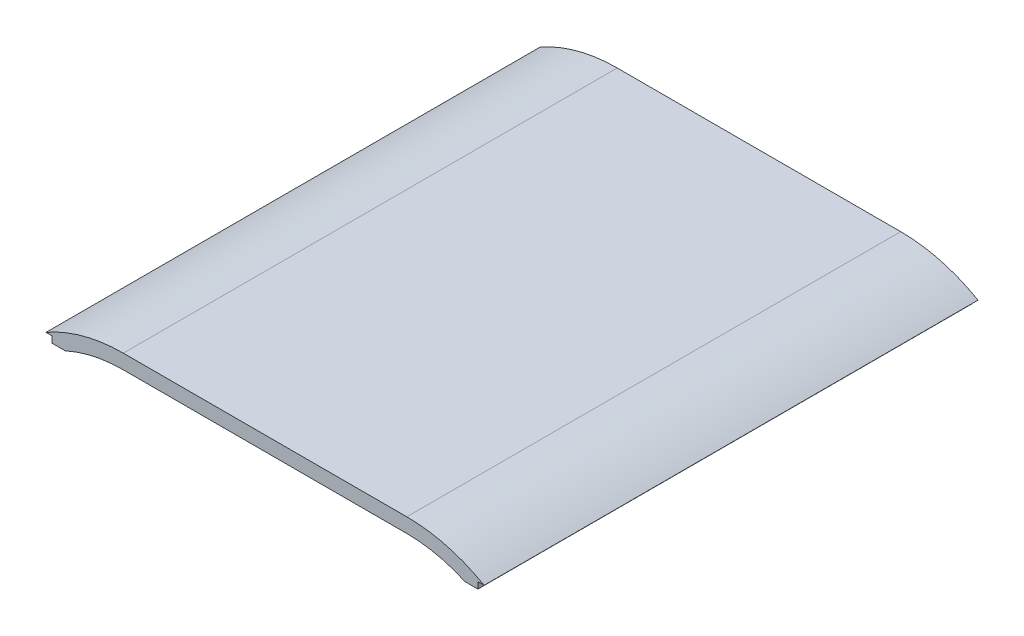
ISO-10303-21;
HEADER;
FILE_DESCRIPTION(('STEP AP214'),'2;1');
FILE_NAME('part.step','',(''),(''),'','','');
FILE_SCHEMA(('AUTOMOTIVE_DESIGN { 1 0 10303 214 1 1 1 1 }'));
ENDSEC;
DATA;
#1=APPLICATION_CONTEXT('core data for automotive mechanical design processes');
#2=APPLICATION_PROTOCOL_DEFINITION('international standard','automotive_design',2000,#1);
#3=PRODUCT_CONTEXT('',#1,'mechanical');
#4=PRODUCT('Part','Part','',(#3));
#5=PRODUCT_RELATED_PRODUCT_CATEGORY('part','',(#4));
#6=PRODUCT_DEFINITION_FORMATION('','',#4);
#7=PRODUCT_DEFINITION_CONTEXT('part definition',#1,'design');
#8=PRODUCT_DEFINITION('design','',#6,#7);
#9=PRODUCT_DEFINITION_SHAPE('','',#8);
#10=(LENGTH_UNIT() NAMED_UNIT(*) SI_UNIT(.MILLI.,.METRE.));
#11=(NAMED_UNIT(*) PLANE_ANGLE_UNIT() SI_UNIT($,.RADIAN.));
#12=(NAMED_UNIT(*) SI_UNIT($,.STERADIAN.) SOLID_ANGLE_UNIT());
#13=UNCERTAINTY_MEASURE_WITH_UNIT(LENGTH_MEASURE(1.E-05),#10,'distance_accuracy_value','');
#14=(GEOMETRIC_REPRESENTATION_CONTEXT(3) GLOBAL_UNCERTAINTY_ASSIGNED_CONTEXT((#13)) GLOBAL_UNIT_ASSIGNED_CONTEXT((#10,
#11,#12)) REPRESENTATION_CONTEXT('',''));
#15=CARTESIAN_POINT('',(0.,0.,0.));
#16=DIRECTION('',(0.,0.,1.));
#17=DIRECTION('',(1.,0.,0.));
#18=AXIS2_PLACEMENT_3D('',#15,#16,#17);
#19=CARTESIAN_POINT('',(-4.04219721862561E-10,-3.77974561371897E-12,238.999999999999));
#20=DIRECTION('',(0.,0.,1.));
#21=DIRECTION('',(1.,0.,0.));
#22=AXIS2_PLACEMENT_3D('',#19,#20,#21);
#23=PLANE('',#22);
#24=CARTESIAN_POINT('',(-68.5834261326637,87.2134363822639,238.999999999999));
#25=DIRECTION('',(0.,0.,1.));
#26=DIRECTION('',(1.,0.,0.));
#27=AXIS2_PLACEMENT_3D('',#24,#25,#26);
#28=CIRCLE('',#27,68.0000000000007);
#29=CARTESIAN_POINT('',(-68.5834261326637,155.213436382265,238.999999999999));
#30=VERTEX_POINT('',#29);
#31=CARTESIAN_POINT('',(-96.7212535541301,149.118708112545,238.999999999999));
#32=VERTEX_POINT('',#31);
#33=EDGE_CURVE('E129',#30,#32,#28,.T.);
#34=ORIENTED_EDGE('',*,*,#33,.F.);
#35=DIRECTION('',(1.,0.,0.));
#36=VECTOR('',#35,1.);
#37=CARTESIAN_POINT('',(0.,155.213436382264,238.999999999999));
#38=LINE('',#37,#36);
#39=CARTESIAN_POINT('',(68.5834261318553,155.213436382265,238.999999999999));
#40=VERTEX_POINT('',#39);
#41=EDGE_CURVE('E149',#30,#40,#38,.T.);
#42=ORIENTED_EDGE('',*,*,#41,.T.);
#43=CARTESIAN_POINT('',(68.5834261326637,87.2134363822639,238.999999999999));
#44=DIRECTION('',(0.,0.,1.));
#45=DIRECTION('',(1.,0.,0.));
#46=AXIS2_PLACEMENT_3D('',#43,#44,#45);
#47=CIRCLE('',#46,68.0000000000007);
#48=CARTESIAN_POINT('',(96.7212535541302,149.118708112545,238.999999999999));
#49=VERTEX_POINT('',#48);
#50=EDGE_CURVE('E151',#40,#49,#47,.F.);
#51=ORIENTED_EDGE('',*,*,#50,.T.);
#52=DIRECTION('',(1.,0.,0.));
#53=VECTOR('',#52,1.);
#54=CARTESIAN_POINT('',(0.,149.118708112545,238.999999999999));
#55=LINE('',#54,#53);
#56=CARTESIAN_POINT('',(103.000000000403,149.118708112545,238.999999999999));
#57=VERTEX_POINT('',#56);
#58=EDGE_CURVE('E153',#49,#57,#55,.T.);
#59=ORIENTED_EDGE('',*,*,#58,.T.);
#60=DIRECTION('',(0.,1.,0.));
#61=VECTOR('',#60,1.);
#62=CARTESIAN_POINT('',(103.000000000403,0.,238.999999999999));
#63=LINE('',#62,#61);
#64=CARTESIAN_POINT('',(103.000000000403,152.213436382267,238.999999999999));
#65=VERTEX_POINT('',#64);
#66=EDGE_CURVE('E155',#57,#65,#63,.T.);
#67=ORIENTED_EDGE('',*,*,#66,.T.);
#68=DIRECTION('',(1.,-1.13797860054735E-12,0.));
#69=VECTOR('',#68,1.);
#70=CARTESIAN_POINT('',(1.73215633318929E-10,152.213436382384,238.999999999999));
#71=LINE('',#70,#69);
#72=CARTESIAN_POINT('',(105.999999999595,152.213436382264,238.999999999999));
#73=VERTEX_POINT('',#72);
#74=EDGE_CURVE('E157',#65,#73,#71,.T.);
#75=ORIENTED_EDGE('',*,*,#74,.T.);
#76=CARTESIAN_POINT('',(68.5834261318553,87.2134363822639,238.999999999999));
#77=DIRECTION('',(0.,0.,1.));
#78=DIRECTION('',(1.,0.,0.));
#79=AXIS2_PLACEMENT_3D('',#76,#77,#78);
#80=CIRCLE('',#79,75.);
#81=CARTESIAN_POINT('',(68.5834261318553,162.213436382264,238.999999999999));
#82=VERTEX_POINT('',#81);
#83=EDGE_CURVE('E159',#73,#82,#80,.T.);
#84=ORIENTED_EDGE('',*,*,#83,.T.);
#85=DIRECTION('',(1.,0.,0.));
#86=VECTOR('',#85,1.);
#87=CARTESIAN_POINT('',(0.,162.213436382264,238.999999999999));
#88=LINE('',#87,#86);
#89=CARTESIAN_POINT('',(-68.5834261326637,162.213436382265,238.999999999999));
#90=VERTEX_POINT('',#89);
#91=EDGE_CURVE('E162',#90,#82,#88,.T.);
#92=ORIENTED_EDGE('',*,*,#91,.F.);
#93=CARTESIAN_POINT('',(-68.5834261326637,87.2134363822639,238.999999999999));
#94=DIRECTION('',(0.,0.,1.));
#95=DIRECTION('',(1.,0.,0.));
#96=AXIS2_PLACEMENT_3D('',#93,#94,#95);
#97=CIRCLE('',#96,75.0000000000014);
#98=CARTESIAN_POINT('',(-106.000000000403,152.213436382267,238.999999999999));
#99=VERTEX_POINT('',#98);
#100=EDGE_CURVE('E161',#90,#99,#97,.T.);
#101=ORIENTED_EDGE('',*,*,#100,.T.);
#102=DIRECTION('',(1.,0.,0.));
#103=VECTOR('',#102,1.);
#104=CARTESIAN_POINT('',(0.,152.213436382267,238.999999999999));
#105=LINE('',#104,#103);
#106=CARTESIAN_POINT('',(-103.000000000403,152.213436382267,238.999999999999));
#107=VERTEX_POINT('',#106);
#108=EDGE_CURVE('E168',#99,#107,#105,.T.);
#109=ORIENTED_EDGE('',*,*,#108,.T.);
#110=DIRECTION('',(0.,1.,0.));
#111=VECTOR('',#110,1.);
#112=CARTESIAN_POINT('',(-103.000000000403,0.,238.999999999999));
#113=LINE('',#112,#111);
#114=CARTESIAN_POINT('',(-103.000000000403,149.118708112545,238.999999999999));
#115=VERTEX_POINT('',#114);
#116=EDGE_CURVE('E122',#115,#107,#113,.T.);
#117=ORIENTED_EDGE('',*,*,#116,.F.);
#118=DIRECTION('',(-1.,0.,0.));
#119=VECTOR('',#118,1.);
#120=CARTESIAN_POINT('',(-1.31837640335979E-12,149.118708112546,238.999999999999));
#121=LINE('',#120,#119);
#122=EDGE_CURVE('E126',#32,#115,#121,.T.);
#123=ORIENTED_EDGE('',*,*,#122,.F.);
#124=EDGE_LOOP('',(#34,#42,#51,#59,#67,#75,#84,#92,#101,#109,#117,#123));
#125=FACE_BOUND('',#124,.T.);
#126=ADVANCED_FACE('F39',(#125),#23,.T.);
#127=CARTESIAN_POINT('',(0.,0.,0.));
#128=DIRECTION('',(0.,0.,1.));
#129=DIRECTION('',(1.,0.,0.));
#130=AXIS2_PLACEMENT_3D('',#127,#128,#129);
#131=PLANE('',#130);
#132=DIRECTION('',(1.,0.,0.));
#133=VECTOR('',#132,1.);
#134=CARTESIAN_POINT('',(0.,155.213436382264,0.));
#135=LINE('',#134,#133);
#136=CARTESIAN_POINT('',(-68.5834261326637,155.213436382264,0.));
#137=VERTEX_POINT('',#136);
#138=CARTESIAN_POINT('',(68.5834261318553,155.213436382264,0.));
#139=VERTEX_POINT('',#138);
#140=EDGE_CURVE('E11',#137,#139,#135,.T.);
#141=ORIENTED_EDGE('',*,*,#140,.F.);
#142=CARTESIAN_POINT('',(-68.5834261326637,87.2134363822639,0.));
#143=DIRECTION('',(0.,0.,1.));
#144=DIRECTION('',(1.,0.,0.));
#145=AXIS2_PLACEMENT_3D('',#142,#143,#144);
#146=CIRCLE('',#145,68.0000000000007);
#147=CARTESIAN_POINT('',(-96.7212535541301,149.118708112545,0.));
#148=VERTEX_POINT('',#147);
#149=EDGE_CURVE('E170',#137,#148,#146,.T.);
#150=ORIENTED_EDGE('',*,*,#149,.T.);
#151=DIRECTION('',(-1.,0.,0.));
#152=VECTOR('',#151,1.);
#153=CARTESIAN_POINT('',(-1.31837640335979E-12,149.118708112546,0.));
#154=LINE('',#153,#152);
#155=CARTESIAN_POINT('',(-103.000000000403,149.118708112545,0.));
#156=VERTEX_POINT('',#155);
#157=EDGE_CURVE('E137',#148,#156,#154,.T.);
#158=ORIENTED_EDGE('',*,*,#157,.T.);
#159=DIRECTION('',(0.,1.,0.));
#160=VECTOR('',#159,1.);
#161=CARTESIAN_POINT('',(-103.000000000403,0.,0.));
#162=LINE('',#161,#160);
#163=CARTESIAN_POINT('',(-103.000000000403,152.213436382267,0.));
#164=VERTEX_POINT('',#163);
#165=EDGE_CURVE('E145',#156,#164,#162,.T.);
#166=ORIENTED_EDGE('',*,*,#165,.T.);
#167=DIRECTION('',(1.,0.,0.));
#168=VECTOR('',#167,1.);
#169=CARTESIAN_POINT('',(0.,152.213436382267,0.));
#170=LINE('',#169,#168);
#171=CARTESIAN_POINT('',(-106.000000000403,152.213436382267,0.));
#172=VERTEX_POINT('',#171);
#173=EDGE_CURVE('E191',#172,#164,#170,.T.);
#174=ORIENTED_EDGE('',*,*,#173,.F.);
#175=CARTESIAN_POINT('',(-68.5834261326637,87.2134363822639,0.));
#176=DIRECTION('',(0.,0.,1.));
#177=DIRECTION('',(1.,0.,0.));
#178=AXIS2_PLACEMENT_3D('',#175,#176,#177);
#179=CIRCLE('',#178,75.0000000000014);
#180=CARTESIAN_POINT('',(-68.5834261326637,162.213436382264,0.));
#181=VERTEX_POINT('',#180);
#182=EDGE_CURVE('E166',#181,#172,#179,.T.);
#183=ORIENTED_EDGE('',*,*,#182,.F.);
#184=DIRECTION('',(1.,0.,0.));
#185=VECTOR('',#184,1.);
#186=CARTESIAN_POINT('',(0.,162.213436382264,0.));
#187=LINE('',#186,#185);
#188=CARTESIAN_POINT('',(68.5834261318553,162.213436382264,0.));
#189=VERTEX_POINT('',#188);
#190=EDGE_CURVE('E142',#181,#189,#187,.T.);
#191=ORIENTED_EDGE('',*,*,#190,.T.);
#192=CARTESIAN_POINT('',(68.5834261318553,87.2134363822639,0.));
#193=DIRECTION('',(0.,0.,1.));
#194=DIRECTION('',(1.,0.,0.));
#195=AXIS2_PLACEMENT_3D('',#192,#193,#194);
#196=CIRCLE('',#195,75.);
#197=CARTESIAN_POINT('',(105.999999999595,152.213436382264,0.));
#198=VERTEX_POINT('',#197);
#199=EDGE_CURVE('E185',#198,#189,#196,.T.);
#200=ORIENTED_EDGE('',*,*,#199,.F.);
#201=DIRECTION('',(1.,-1.13797860054735E-12,0.));
#202=VECTOR('',#201,1.);
#203=CARTESIAN_POINT('',(1.73215633318929E-10,152.213436382384,0.));
#204=LINE('',#203,#202);
#205=CARTESIAN_POINT('',(103.000000000403,152.213436382267,0.));
#206=VERTEX_POINT('',#205);
#207=EDGE_CURVE('E182',#206,#198,#204,.T.);
#208=ORIENTED_EDGE('',*,*,#207,.F.);
#209=DIRECTION('',(0.,1.,0.));
#210=VECTOR('',#209,1.);
#211=CARTESIAN_POINT('',(103.000000000403,0.,0.));
#212=LINE('',#211,#210);
#213=CARTESIAN_POINT('',(103.000000000403,149.118708112545,0.));
#214=VERTEX_POINT('',#213);
#215=EDGE_CURVE('E179',#214,#206,#212,.T.);
#216=ORIENTED_EDGE('',*,*,#215,.F.);
#217=DIRECTION('',(1.,0.,0.));
#218=VECTOR('',#217,1.);
#219=CARTESIAN_POINT('',(0.,149.118708112545,0.));
#220=LINE('',#219,#218);
#221=CARTESIAN_POINT('',(96.7212535541302,149.118708112545,0.));
#222=VERTEX_POINT('',#221);
#223=EDGE_CURVE('E176',#222,#214,#220,.T.);
#224=ORIENTED_EDGE('',*,*,#223,.F.);
#225=CARTESIAN_POINT('',(68.5834261326637,87.2134363822639,0.));
#226=DIRECTION('',(0.,0.,1.));
#227=DIRECTION('',(1.,0.,0.));
#228=AXIS2_PLACEMENT_3D('',#225,#226,#227);
#229=CIRCLE('',#228,68.0000000000007);
#230=EDGE_CURVE('E175',#139,#222,#229,.F.);
#231=ORIENTED_EDGE('',*,*,#230,.F.);
#232=EDGE_LOOP('',(#141,#150,#158,#166,#174,#183,#191,#200,#208,#216,#224,#231));
#233=FACE_BOUND('',#232,.T.);
#234=ADVANCED_FACE('F204',(#233),#131,.F.);
#235=CARTESIAN_POINT('',(-68.5834261326637,87.2134363822639,451.404029878099));
#236=DIRECTION('',(0.,0.,-1.));
#237=DIRECTION('',(-1.,0.,0.));
#238=AXIS2_PLACEMENT_3D('',#235,#236,#237);
#239=CYLINDRICAL_SURFACE('',#238,68.0000000000007);
#240=DIRECTION('',(0.,0.,-1.));
#241=VECTOR('',#240,1.);
#242=CARTESIAN_POINT('',(-68.5834261326637,155.213436382264,451.404029878099));
#243=LINE('',#242,#241);
#244=EDGE_CURVE('E42',#30,#137,#243,.T.);
#245=ORIENTED_EDGE('',*,*,#244,.F.);
#246=ORIENTED_EDGE('',*,*,#33,.T.);
#247=DIRECTION('',(0.,0.,-1.));
#248=VECTOR('',#247,1.);
#249=CARTESIAN_POINT('',(-96.7212535541301,149.118708112545,451.404029878099));
#250=LINE('',#249,#248);
#251=EDGE_CURVE('E132',#32,#148,#250,.T.);
#252=ORIENTED_EDGE('',*,*,#251,.T.);
#253=ORIENTED_EDGE('',*,*,#149,.F.);
#254=EDGE_LOOP('',(#245,#246,#252,#253));
#255=FACE_BOUND('',#254,.T.);
#256=ADVANCED_FACE('F141',(#255),#239,.F.);
#257=CARTESIAN_POINT('',(-1.31837640335979E-12,149.118708112546,451.404029878099));
#258=DIRECTION('',(0.,-1.,0.));
#259=DIRECTION('',(1.,0.,0.));
#260=AXIS2_PLACEMENT_3D('',#257,#258,#259);
#261=PLANE('',#260);
#262=ORIENTED_EDGE('',*,*,#251,.F.);
#263=ORIENTED_EDGE('',*,*,#122,.T.);
#264=DIRECTION('',(0.,0.,-1.));
#265=VECTOR('',#264,1.);
#266=CARTESIAN_POINT('',(-103.000000000403,149.118708112545,451.404029878099));
#267=LINE('',#266,#265);
#268=EDGE_CURVE('E131',#115,#156,#267,.T.);
#269=ORIENTED_EDGE('',*,*,#268,.T.);
#270=ORIENTED_EDGE('',*,*,#157,.F.);
#271=EDGE_LOOP('',(#262,#263,#269,#270));
#272=FACE_BOUND('',#271,.T.);
#273=ADVANCED_FACE('F135',(#272),#261,.T.);
#274=CARTESIAN_POINT('',(-103.000000000403,0.,451.404029878099));
#275=DIRECTION('',(-1.,0.,0.));
#276=DIRECTION('',(0.,0.,1.));
#277=AXIS2_PLACEMENT_3D('',#274,#275,#276);
#278=PLANE('',#277);
#279=ORIENTED_EDGE('',*,*,#268,.F.);
#280=ORIENTED_EDGE('',*,*,#116,.T.);
#281=DIRECTION('',(0.,0.,-1.));
#282=VECTOR('',#281,1.);
#283=CARTESIAN_POINT('',(-103.000000000403,152.213436382267,451.404029878099));
#284=LINE('',#283,#282);
#285=EDGE_CURVE('E171',#107,#164,#284,.T.);
#286=ORIENTED_EDGE('',*,*,#285,.T.);
#287=ORIENTED_EDGE('',*,*,#165,.F.);
#288=EDGE_LOOP('',(#279,#280,#286,#287));
#289=FACE_BOUND('',#288,.T.);
#290=ADVANCED_FACE('F198',(#289),#278,.T.);
#291=CARTESIAN_POINT('',(0.,152.213436382267,451.404029878099));
#292=DIRECTION('',(0.,1.,0.));
#293=DIRECTION('',(0.,0.,1.));
#294=AXIS2_PLACEMENT_3D('',#291,#292,#293);
#295=PLANE('',#294);
#296=ORIENTED_EDGE('',*,*,#108,.F.);
#297=DIRECTION('',(0.,0.,-1.));
#298=VECTOR('',#297,1.);
#299=CARTESIAN_POINT('',(-106.000000000403,152.213436382267,451.404029878099));
#300=LINE('',#299,#298);
#301=EDGE_CURVE('E192',#99,#172,#300,.T.);
#302=ORIENTED_EDGE('',*,*,#301,.T.);
#303=ORIENTED_EDGE('',*,*,#173,.T.);
#304=ORIENTED_EDGE('',*,*,#285,.F.);
#305=EDGE_LOOP('',(#296,#302,#303,#304));
#306=FACE_BOUND('',#305,.T.);
#307=ADVANCED_FACE('F256',(#306),#295,.F.);
#308=CARTESIAN_POINT('',(-68.5834261326637,87.2134363822639,451.404029878099));
#309=DIRECTION('',(0.,0.,-1.));
#310=DIRECTION('',(-1.,0.,0.));
#311=AXIS2_PLACEMENT_3D('',#308,#309,#310);
#312=CYLINDRICAL_SURFACE('',#311,75.0000000000014);
#313=ORIENTED_EDGE('',*,*,#100,.F.);
#314=DIRECTION('',(0.,0.,-1.));
#315=VECTOR('',#314,1.);
#316=CARTESIAN_POINT('',(-68.5834261326637,162.213436382264,451.404029878099));
#317=LINE('',#316,#315);
#318=EDGE_CURVE('E189',#90,#181,#317,.T.);
#319=ORIENTED_EDGE('',*,*,#318,.T.);
#320=ORIENTED_EDGE('',*,*,#182,.T.);
#321=ORIENTED_EDGE('',*,*,#301,.F.);
#322=EDGE_LOOP('',(#313,#319,#320,#321));
#323=FACE_BOUND('',#322,.T.);
#324=ADVANCED_FACE('F259',(#323),#312,.T.);
#325=CARTESIAN_POINT('',(0.,162.213436382264,451.404029878099));
#326=DIRECTION('',(0.,1.,0.));
#327=DIRECTION('',(0.,0.,1.));
#328=AXIS2_PLACEMENT_3D('',#325,#326,#327);
#329=PLANE('',#328);
#330=ORIENTED_EDGE('',*,*,#318,.F.);
#331=ORIENTED_EDGE('',*,*,#91,.T.);
#332=DIRECTION('',(0.,0.,-1.));
#333=VECTOR('',#332,1.);
#334=CARTESIAN_POINT('',(68.5834261318553,162.213436382264,451.404029878099));
#335=LINE('',#334,#333);
#336=EDGE_CURVE('E165',#82,#189,#335,.T.);
#337=ORIENTED_EDGE('',*,*,#336,.T.);
#338=ORIENTED_EDGE('',*,*,#190,.F.);
#339=EDGE_LOOP('',(#330,#331,#337,#338));
#340=FACE_BOUND('',#339,.T.);
#341=ADVANCED_FACE('F263',(#340),#329,.T.);
#342=CARTESIAN_POINT('',(68.5834261318553,87.2134363822639,451.404029878099));
#343=DIRECTION('',(0.,0.,-1.));
#344=DIRECTION('',(-1.,0.,0.));
#345=AXIS2_PLACEMENT_3D('',#342,#343,#344);
#346=CYLINDRICAL_SURFACE('',#345,75.);
#347=ORIENTED_EDGE('',*,*,#83,.F.);
#348=DIRECTION('',(0.,0.,-1.));
#349=VECTOR('',#348,1.);
#350=CARTESIAN_POINT('',(105.999999999595,152.213436382264,451.404029878099));
#351=LINE('',#350,#349);
#352=EDGE_CURVE('E186',#73,#198,#351,.T.);
#353=ORIENTED_EDGE('',*,*,#352,.T.);
#354=ORIENTED_EDGE('',*,*,#199,.T.);
#355=ORIENTED_EDGE('',*,*,#336,.F.);
#356=EDGE_LOOP('',(#347,#353,#354,#355));
#357=FACE_BOUND('',#356,.T.);
#358=ADVANCED_FACE('F267',(#357),#346,.T.);
#359=CARTESIAN_POINT('',(1.73215633318929E-10,152.213436382384,451.404029878099));
#360=DIRECTION('',(1.13797860054735E-12,1.,0.));
#361=DIRECTION('',(-1.,1.13797860054735E-12,0.));
#362=AXIS2_PLACEMENT_3D('',#359,#360,#361);
#363=PLANE('',#362);
#364=ORIENTED_EDGE('',*,*,#74,.F.);
#365=DIRECTION('',(0.,0.,-1.));
#366=VECTOR('',#365,1.);
#367=CARTESIAN_POINT('',(103.000000000403,152.213436382267,451.404029878099));
#368=LINE('',#367,#366);
#369=EDGE_CURVE('E183',#65,#206,#368,.T.);
#370=ORIENTED_EDGE('',*,*,#369,.T.);
#371=ORIENTED_EDGE('',*,*,#207,.T.);
#372=ORIENTED_EDGE('',*,*,#352,.F.);
#373=EDGE_LOOP('',(#364,#370,#371,#372));
#374=FACE_BOUND('',#373,.T.);
#375=ADVANCED_FACE('F271',(#374),#363,.F.);
#376=CARTESIAN_POINT('',(103.000000000403,0.,451.404029878099));
#377=DIRECTION('',(-1.,0.,0.));
#378=DIRECTION('',(0.,0.,1.));
#379=AXIS2_PLACEMENT_3D('',#376,#377,#378);
#380=PLANE('',#379);
#381=ORIENTED_EDGE('',*,*,#66,.F.);
#382=DIRECTION('',(0.,0.,-1.));
#383=VECTOR('',#382,1.);
#384=CARTESIAN_POINT('',(103.000000000403,149.118708112545,451.404029878099));
#385=LINE('',#384,#383);
#386=EDGE_CURVE('E180',#57,#214,#385,.T.);
#387=ORIENTED_EDGE('',*,*,#386,.T.);
#388=ORIENTED_EDGE('',*,*,#215,.T.);
#389=ORIENTED_EDGE('',*,*,#369,.F.);
#390=EDGE_LOOP('',(#381,#387,#388,#389));
#391=FACE_BOUND('',#390,.T.);
#392=ADVANCED_FACE('F275',(#391),#380,.F.);
#393=CARTESIAN_POINT('',(0.,149.118708112545,451.404029878099));
#394=DIRECTION('',(0.,1.,0.));
#395=DIRECTION('',(0.,0.,1.));
#396=AXIS2_PLACEMENT_3D('',#393,#394,#395);
#397=PLANE('',#396);
#398=ORIENTED_EDGE('',*,*,#58,.F.);
#399=DIRECTION('',(0.,0.,-1.));
#400=VECTOR('',#399,1.);
#401=CARTESIAN_POINT('',(96.7212535541302,149.118708112545,451.404029878099));
#402=LINE('',#401,#400);
#403=EDGE_CURVE('E177',#49,#222,#402,.T.);
#404=ORIENTED_EDGE('',*,*,#403,.T.);
#405=ORIENTED_EDGE('',*,*,#223,.T.);
#406=ORIENTED_EDGE('',*,*,#386,.F.);
#407=EDGE_LOOP('',(#398,#404,#405,#406));
#408=FACE_BOUND('',#407,.T.);
#409=ADVANCED_FACE('F231',(#408),#397,.F.);
#410=CARTESIAN_POINT('',(68.5834261326637,87.2134363822639,451.404029878099));
#411=DIRECTION('',(0.,0.,-1.));
#412=DIRECTION('',(-1.,0.,0.));
#413=AXIS2_PLACEMENT_3D('',#410,#411,#412);
#414=CYLINDRICAL_SURFACE('',#413,68.0000000000007);
#415=ORIENTED_EDGE('',*,*,#50,.F.);
#416=DIRECTION('',(0.,0.,-1.));
#417=VECTOR('',#416,1.);
#418=CARTESIAN_POINT('',(68.5834261318553,155.213436382264,451.404029878099));
#419=LINE('',#418,#417);
#420=EDGE_CURVE('E173',#40,#139,#419,.T.);
#421=ORIENTED_EDGE('',*,*,#420,.T.);
#422=ORIENTED_EDGE('',*,*,#230,.T.);
#423=ORIENTED_EDGE('',*,*,#403,.F.);
#424=EDGE_LOOP('',(#415,#421,#422,#423));
#425=FACE_BOUND('',#424,.T.);
#426=ADVANCED_FACE('F224',(#425),#414,.F.);
#427=CARTESIAN_POINT('',(0.,155.213436382264,451.404029878099));
#428=DIRECTION('',(0.,1.,0.));
#429=DIRECTION('',(0.,0.,1.));
#430=AXIS2_PLACEMENT_3D('',#427,#428,#429);
#431=PLANE('',#430);
#432=ORIENTED_EDGE('',*,*,#41,.F.);
#433=ORIENTED_EDGE('',*,*,#244,.T.);
#434=ORIENTED_EDGE('',*,*,#140,.T.);
#435=ORIENTED_EDGE('',*,*,#420,.F.);
#436=EDGE_LOOP('',(#432,#433,#434,#435));
#437=FACE_BOUND('',#436,.T.);
#438=ADVANCED_FACE('F234',(#437),#431,.F.);
#439=CLOSED_SHELL('',(#126,#234,#256,#273,#290,#307,#324,#341,#358,#375,#392,#409,#426,#438));
#440=MANIFOLD_SOLID_BREP('B2',#439);
#441=ADVANCED_BREP_SHAPE_REPRESENTATION('',(#18,#440),#14);
#442=SHAPE_DEFINITION_REPRESENTATION(#9,#441);
ENDSEC;
END-ISO-10303-21;
